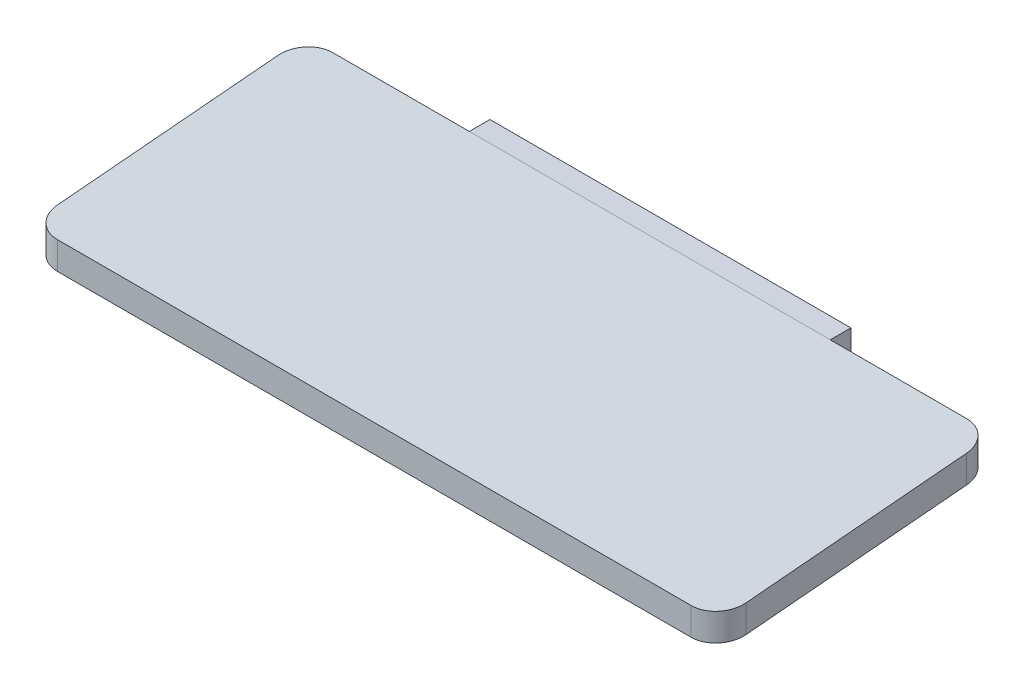
ISO-10303-21;
HEADER;
FILE_DESCRIPTION(('STEP AP214'),'2;1');
FILE_NAME('part.step','',(''),(''),'','','');
FILE_SCHEMA(('AUTOMOTIVE_DESIGN { 1 0 10303 214 1 1 1 1 }'));
ENDSEC;
DATA;
#1=APPLICATION_CONTEXT('core data for automotive mechanical design processes');
#2=APPLICATION_PROTOCOL_DEFINITION('international standard','automotive_design',2000,#1);
#3=PRODUCT_CONTEXT('',#1,'mechanical');
#4=PRODUCT('Part','Part','',(#3));
#5=PRODUCT_RELATED_PRODUCT_CATEGORY('part','',(#4));
#6=PRODUCT_DEFINITION_FORMATION('','',#4);
#7=PRODUCT_DEFINITION_CONTEXT('part definition',#1,'design');
#8=PRODUCT_DEFINITION('design','',#6,#7);
#9=PRODUCT_DEFINITION_SHAPE('','',#8);
#10=(LENGTH_UNIT() NAMED_UNIT(*) SI_UNIT(.MILLI.,.METRE.));
#11=(NAMED_UNIT(*) PLANE_ANGLE_UNIT() SI_UNIT($,.RADIAN.));
#12=(NAMED_UNIT(*) SI_UNIT($,.STERADIAN.) SOLID_ANGLE_UNIT());
#13=UNCERTAINTY_MEASURE_WITH_UNIT(LENGTH_MEASURE(1.E-05),#10,'distance_accuracy_value','');
#14=(GEOMETRIC_REPRESENTATION_CONTEXT(3) GLOBAL_UNCERTAINTY_ASSIGNED_CONTEXT((#13)) GLOBAL_UNIT_ASSIGNED_CONTEXT((#10,
#11,#12)) REPRESENTATION_CONTEXT('',''));
#15=CARTESIAN_POINT('',(0.,0.,0.));
#16=DIRECTION('',(0.,0.,1.));
#17=DIRECTION('',(1.,0.,0.));
#18=AXIS2_PLACEMENT_3D('',#15,#16,#17);
#19=CARTESIAN_POINT('',(0.,0.,1.5));
#20=DIRECTION('',(0.,0.,-1.));
#21=DIRECTION('',(-1.,0.,0.));
#22=AXIS2_PLACEMENT_3D('',#19,#20,#21);
#23=PLANE('',#22);
#24=CARTESIAN_POINT('',(-7.99999999999997,46.,1.5));
#25=DIRECTION('',(0.,0.,1.));
#26=DIRECTION('',(1.,0.,0.));
#27=AXIS2_PLACEMENT_3D('',#24,#25,#26);
#28=CIRCLE('',#27,2.1);
#29=CARTESIAN_POINT('',(-5.89999999999998,46.,1.5));
#30=VERTEX_POINT('',#29);
#31=EDGE_CURVE('E201',#30,#30,#28,.T.);
#32=ORIENTED_EDGE('',*,*,#31,.F.);
#33=EDGE_LOOP('',(#32));
#34=FACE_BOUND('',#33,.T.);
#35=CARTESIAN_POINT('',(8.00000000000003,46.,1.5));
#36=DIRECTION('',(0.,0.,1.));
#37=DIRECTION('',(1.,0.,0.));
#38=AXIS2_PLACEMENT_3D('',#35,#36,#37);
#39=CIRCLE('',#38,2.1);
#40=CARTESIAN_POINT('',(10.1,46.,1.5));
#41=VERTEX_POINT('',#40);
#42=EDGE_CURVE('E207',#41,#41,#39,.T.);
#43=ORIENTED_EDGE('',*,*,#42,.F.);
#44=EDGE_LOOP('',(#43));
#45=FACE_BOUND('',#44,.T.);
#46=DIRECTION('',(0.,-1.,0.));
#47=VECTOR('',#46,1.);
#48=CARTESIAN_POINT('',(-13.1,39.9,1.5));
#49=LINE('',#48,#47);
#50=CARTESIAN_POINT('',(-13.1,50.9,1.5));
#51=VERTEX_POINT('',#50);
#52=CARTESIAN_POINT('',(-13.1,41.9,1.5));
#53=VERTEX_POINT('',#52);
#54=EDGE_CURVE('E216',#51,#53,#49,.T.);
#55=ORIENTED_EDGE('',*,*,#54,.T.);
#56=CARTESIAN_POINT('',(-11.1,41.9,1.5));
#57=DIRECTION('',(0.,0.,-1.));
#58=DIRECTION('',(-1.,0.,0.));
#59=AXIS2_PLACEMENT_3D('',#56,#57,#58);
#60=CIRCLE('',#59,2.);
#61=CARTESIAN_POINT('',(-11.1,39.9,1.5));
#62=VERTEX_POINT('',#61);
#63=EDGE_CURVE('E256',#53,#62,#60,.F.);
#64=ORIENTED_EDGE('',*,*,#63,.T.);
#65=DIRECTION('',(1.,0.,0.));
#66=VECTOR('',#65,1.);
#67=CARTESIAN_POINT('',(-13.1,39.9,1.5));
#68=LINE('',#67,#66);
#69=CARTESIAN_POINT('',(11.1,39.9,1.5));
#70=VERTEX_POINT('',#69);
#71=EDGE_CURVE('E180',#62,#70,#68,.T.);
#72=ORIENTED_EDGE('',*,*,#71,.T.);
#73=CARTESIAN_POINT('',(11.1,41.9,1.5));
#74=DIRECTION('',(0.,0.,-1.));
#75=DIRECTION('',(-1.,0.,0.));
#76=AXIS2_PLACEMENT_3D('',#73,#74,#75);
#77=CIRCLE('',#76,2.);
#78=CARTESIAN_POINT('',(13.1,41.9,1.5));
#79=VERTEX_POINT('',#78);
#80=EDGE_CURVE('E254',#70,#79,#77,.F.);
#81=ORIENTED_EDGE('',*,*,#80,.T.);
#82=DIRECTION('',(0.,1.,0.));
#83=VECTOR('',#82,1.);
#84=CARTESIAN_POINT('',(13.1,39.9,1.5));
#85=LINE('',#84,#83);
#86=CARTESIAN_POINT('',(13.1,50.9,1.5));
#87=VERTEX_POINT('',#86);
#88=EDGE_CURVE('E179',#79,#87,#85,.T.);
#89=ORIENTED_EDGE('',*,*,#88,.T.);
#90=DIRECTION('',(-1.,0.,0.));
#91=VECTOR('',#90,1.);
#92=CARTESIAN_POINT('',(0.,50.9,1.5));
#93=LINE('',#92,#91);
#94=EDGE_CURVE('E167',#87,#51,#93,.T.);
#95=ORIENTED_EDGE('',*,*,#94,.T.);
#96=EDGE_LOOP('',(#55,#64,#72,#81,#89,#95));
#97=FACE_BOUND('',#96,.T.);
#98=ADVANCED_FACE('F35',(#34,#45,#97),#23,.F.);
#99=CARTESIAN_POINT('',(0.,0.,0.));
#100=DIRECTION('',(0.,0.,-1.));
#101=DIRECTION('',(-1.,0.,0.));
#102=AXIS2_PLACEMENT_3D('',#99,#100,#101);
#103=PLANE('',#102);
#104=CARTESIAN_POINT('',(8.00000000000003,46.,0.));
#105=DIRECTION('',(0.,0.,1.));
#106=DIRECTION('',(1.,0.,0.));
#107=AXIS2_PLACEMENT_3D('',#104,#105,#106);
#108=CIRCLE('',#107,2.1);
#109=CARTESIAN_POINT('',(10.1,46.,0.));
#110=VERTEX_POINT('',#109);
#111=EDGE_CURVE('E204',#110,#110,#108,.T.);
#112=ORIENTED_EDGE('',*,*,#111,.T.);
#113=EDGE_LOOP('',(#112));
#114=FACE_BOUND('',#113,.T.);
#115=DIRECTION('',(1.,0.,0.));
#116=VECTOR('',#115,1.);
#117=CARTESIAN_POINT('',(-13.1,39.9,0.));
#118=LINE('',#117,#116);
#119=CARTESIAN_POINT('',(-11.1,39.9,0.));
#120=VERTEX_POINT('',#119);
#121=CARTESIAN_POINT('',(11.1,39.9,0.));
#122=VERTEX_POINT('',#121);
#123=EDGE_CURVE('E225',#120,#122,#118,.T.);
#124=ORIENTED_EDGE('',*,*,#123,.F.);
#125=CARTESIAN_POINT('',(-11.1,41.9,0.));
#126=DIRECTION('',(0.,0.,-1.));
#127=DIRECTION('',(-1.,0.,0.));
#128=AXIS2_PLACEMENT_3D('',#125,#126,#127);
#129=CIRCLE('',#128,2.);
#130=CARTESIAN_POINT('',(-13.1,41.9,0.));
#131=VERTEX_POINT('',#130);
#132=EDGE_CURVE('E250',#120,#131,#129,.T.);
#133=ORIENTED_EDGE('',*,*,#132,.T.);
#134=DIRECTION('',(0.,-1.,0.));
#135=VECTOR('',#134,1.);
#136=CARTESIAN_POINT('',(-13.1,39.9,0.));
#137=LINE('',#136,#135);
#138=CARTESIAN_POINT('',(-13.1,55.9,0.));
#139=VERTEX_POINT('',#138);
#140=EDGE_CURVE('E210',#139,#131,#137,.T.);
#141=ORIENTED_EDGE('',*,*,#140,.F.);
#142=DIRECTION('',(-1.,0.,0.));
#143=VECTOR('',#142,1.);
#144=CARTESIAN_POINT('',(-13.1,55.9,0.));
#145=LINE('',#144,#143);
#146=CARTESIAN_POINT('',(13.1,55.9,0.));
#147=VERTEX_POINT('',#146);
#148=EDGE_CURVE('E230',#147,#139,#145,.T.);
#149=ORIENTED_EDGE('',*,*,#148,.F.);
#150=DIRECTION('',(0.,1.,0.));
#151=VECTOR('',#150,1.);
#152=CARTESIAN_POINT('',(13.1,39.9,0.));
#153=LINE('',#152,#151);
#154=CARTESIAN_POINT('',(13.1,41.9,0.));
#155=VERTEX_POINT('',#154);
#156=EDGE_CURVE('E228',#155,#147,#153,.T.);
#157=ORIENTED_EDGE('',*,*,#156,.F.);
#158=CARTESIAN_POINT('',(11.1,41.9,0.));
#159=DIRECTION('',(0.,0.,-1.));
#160=DIRECTION('',(-1.,0.,0.));
#161=AXIS2_PLACEMENT_3D('',#158,#159,#160);
#162=CIRCLE('',#161,2.);
#163=EDGE_CURVE('E248',#155,#122,#162,.T.);
#164=ORIENTED_EDGE('',*,*,#163,.T.);
#165=EDGE_LOOP('',(#124,#133,#141,#149,#157,#164));
#166=FACE_BOUND('',#165,.T.);
#167=CARTESIAN_POINT('',(-7.99999999999997,46.,0.));
#168=DIRECTION('',(0.,0.,1.));
#169=DIRECTION('',(1.,0.,0.));
#170=AXIS2_PLACEMENT_3D('',#167,#168,#169);
#171=CIRCLE('',#170,2.1);
#172=CARTESIAN_POINT('',(-5.89999999999998,46.,0.));
#173=VERTEX_POINT('',#172);
#174=EDGE_CURVE('E188',#173,#173,#171,.T.);
#175=ORIENTED_EDGE('',*,*,#174,.T.);
#176=EDGE_LOOP('',(#175));
#177=FACE_BOUND('',#176,.T.);
#178=ADVANCED_FACE('F330',(#114,#166,#177),#103,.T.);
#179=CARTESIAN_POINT('',(-13.1,39.9,1.5));
#180=DIRECTION('',(1.,0.,0.));
#181=DIRECTION('',(0.,0.,-1.));
#182=AXIS2_PLACEMENT_3D('',#179,#180,#181);
#183=PLANE('',#182);
#184=ORIENTED_EDGE('',*,*,#140,.T.);
#185=DIRECTION('',(0.,0.,-1.));
#186=VECTOR('',#185,1.);
#187=CARTESIAN_POINT('',(-13.1,41.9,1.5));
#188=LINE('',#187,#186);
#189=EDGE_CURVE('E252',#131,#53,#188,.F.);
#190=ORIENTED_EDGE('',*,*,#189,.T.);
#191=ORIENTED_EDGE('',*,*,#54,.F.);
#192=DIRECTION('',(0.,0.707106781186545,0.70710678118655));
#193=VECTOR('',#192,1.);
#194=CARTESIAN_POINT('',(-13.1,45.4,-4.));
#195=LINE('',#194,#193);
#196=CARTESIAN_POINT('',(-13.1,53.6586494467659,4.25864944676595));
#197=VERTEX_POINT('',#196);
#198=EDGE_CURVE('E241',#51,#197,#195,.T.);
#199=ORIENTED_EDGE('',*,*,#198,.T.);
#200=DIRECTION('',(0.,-0.0871557427476516,0.996194698091746));
#201=VECTOR('',#200,1.);
#202=CARTESIAN_POINT('',(-13.1,52.1502267294817,21.5));
#203=LINE('',#202,#201);
#204=CARTESIAN_POINT('',(-13.1,53.9,1.5));
#205=VERTEX_POINT('',#204);
#206=EDGE_CURVE('E235',#205,#197,#203,.T.);
#207=ORIENTED_EDGE('',*,*,#206,.F.);
#208=CARTESIAN_POINT('',(-13.1,55.9,1.5));
#209=VERTEX_POINT('',#208);
#210=EDGE_CURVE('E213',#209,#205,#49,.T.);
#211=ORIENTED_EDGE('',*,*,#210,.F.);
#212=DIRECTION('',(0.,0.,-1.));
#213=VECTOR('',#212,1.);
#214=CARTESIAN_POINT('',(-13.1,55.9,1.5));
#215=LINE('',#214,#213);
#216=EDGE_CURVE('E222',#209,#139,#215,.T.);
#217=ORIENTED_EDGE('',*,*,#216,.T.);
#218=EDGE_LOOP('',(#184,#190,#191,#199,#207,#211,#217));
#219=FACE_BOUND('',#218,.T.);
#220=ADVANCED_FACE('F336',(#219),#183,.F.);
#221=CARTESIAN_POINT('',(-13.1,39.9,1.5));
#222=DIRECTION('',(0.,1.,0.));
#223=DIRECTION('',(0.,0.,1.));
#224=AXIS2_PLACEMENT_3D('',#221,#222,#223);
#225=PLANE('',#224);
#226=ORIENTED_EDGE('',*,*,#71,.F.);
#227=DIRECTION('',(0.,0.,-1.));
#228=VECTOR('',#227,1.);
#229=CARTESIAN_POINT('',(-11.1,39.9,1.5));
#230=LINE('',#229,#228);
#231=EDGE_CURVE('E245',#62,#120,#230,.T.);
#232=ORIENTED_EDGE('',*,*,#231,.T.);
#233=ORIENTED_EDGE('',*,*,#123,.T.);
#234=DIRECTION('',(0.,0.,-1.));
#235=VECTOR('',#234,1.);
#236=CARTESIAN_POINT('',(11.1,39.9,1.5));
#237=LINE('',#236,#235);
#238=EDGE_CURVE('E243',#122,#70,#237,.F.);
#239=ORIENTED_EDGE('',*,*,#238,.T.);
#240=EDGE_LOOP('',(#226,#232,#233,#239));
#241=FACE_BOUND('',#240,.T.);
#242=ADVANCED_FACE('F351',(#241),#225,.F.);
#243=CARTESIAN_POINT('',(13.1,39.9,1.5));
#244=DIRECTION('',(-1.,0.,0.));
#245=DIRECTION('',(0.,0.,1.));
#246=AXIS2_PLACEMENT_3D('',#243,#244,#245);
#247=PLANE('',#246);
#248=ORIENTED_EDGE('',*,*,#88,.F.);
#249=DIRECTION('',(0.,0.,-1.));
#250=VECTOR('',#249,1.);
#251=CARTESIAN_POINT('',(13.1,41.9,1.5));
#252=LINE('',#251,#250);
#253=EDGE_CURVE('E258',#79,#155,#252,.T.);
#254=ORIENTED_EDGE('',*,*,#253,.T.);
#255=ORIENTED_EDGE('',*,*,#156,.T.);
#256=DIRECTION('',(0.,0.,-1.));
#257=VECTOR('',#256,1.);
#258=CARTESIAN_POINT('',(13.1,55.9,1.5));
#259=LINE('',#258,#257);
#260=CARTESIAN_POINT('',(13.1,55.9,1.5));
#261=VERTEX_POINT('',#260);
#262=EDGE_CURVE('E174',#261,#147,#259,.T.);
#263=ORIENTED_EDGE('',*,*,#262,.F.);
#264=CARTESIAN_POINT('',(13.1,53.9,1.5));
#265=VERTEX_POINT('',#264);
#266=EDGE_CURVE('E170',#265,#261,#85,.T.);
#267=ORIENTED_EDGE('',*,*,#266,.F.);
#268=DIRECTION('',(0.,0.0871557427476516,-0.996194698091746));
#269=VECTOR('',#268,1.);
#270=CARTESIAN_POINT('',(13.1,52.1502267294817,21.5));
#271=LINE('',#270,#269);
#272=CARTESIAN_POINT('',(13.1,53.6586494467659,4.25864944676595));
#273=VERTEX_POINT('',#272);
#274=EDGE_CURVE('E156',#273,#265,#271,.T.);
#275=ORIENTED_EDGE('',*,*,#274,.F.);
#276=DIRECTION('',(0.,-0.707106781186545,-0.70710678118655));
#277=VECTOR('',#276,1.);
#278=CARTESIAN_POINT('',(13.1,45.4,-4.));
#279=LINE('',#278,#277);
#280=EDGE_CURVE('E239',#273,#87,#279,.T.);
#281=ORIENTED_EDGE('',*,*,#280,.T.);
#282=EDGE_LOOP('',(#248,#254,#255,#263,#267,#275,#281));
#283=FACE_BOUND('',#282,.T.);
#284=ADVANCED_FACE('F172',(#283),#247,.F.);
#285=CARTESIAN_POINT('',(-13.1,55.9,1.5));
#286=DIRECTION('',(0.,-1.,0.));
#287=DIRECTION('',(0.,0.,-1.));
#288=AXIS2_PLACEMENT_3D('',#285,#286,#287);
#289=PLANE('',#288);
#290=ORIENTED_EDGE('',*,*,#148,.T.);
#291=ORIENTED_EDGE('',*,*,#216,.F.);
#292=DIRECTION('',(-1.,0.,0.));
#293=VECTOR('',#292,1.);
#294=CARTESIAN_POINT('',(-13.1,55.9,1.5));
#295=LINE('',#294,#293);
#296=EDGE_CURVE('E219',#261,#209,#295,.T.);
#297=ORIENTED_EDGE('',*,*,#296,.F.);
#298=ORIENTED_EDGE('',*,*,#262,.T.);
#299=EDGE_LOOP('',(#290,#291,#297,#298));
#300=FACE_BOUND('',#299,.T.);
#301=ADVANCED_FACE('F345',(#300),#289,.F.);
#302=CARTESIAN_POINT('',(8.00000000000003,46.,1.5));
#303=DIRECTION('',(0.,0.,-1.));
#304=DIRECTION('',(-1.,0.,0.));
#305=AXIS2_PLACEMENT_3D('',#302,#303,#304);
#306=CYLINDRICAL_SURFACE('',#305,2.1);
#307=ORIENTED_EDGE('',*,*,#42,.T.);
#308=EDGE_LOOP('',(#307));
#309=FACE_BOUND('',#308,.T.);
#310=ORIENTED_EDGE('',*,*,#111,.F.);
#311=EDGE_LOOP('',(#310));
#312=FACE_BOUND('',#311,.T.);
#313=ADVANCED_FACE('F342',(#309,#312),#306,.F.);
#314=CARTESIAN_POINT('',(-7.99999999999997,46.,1.5));
#315=DIRECTION('',(0.,0.,-1.));
#316=DIRECTION('',(-1.,0.,0.));
#317=AXIS2_PLACEMENT_3D('',#314,#315,#316);
#318=CYLINDRICAL_SURFACE('',#317,2.1);
#319=ORIENTED_EDGE('',*,*,#31,.T.);
#320=EDGE_LOOP('',(#319));
#321=FACE_BOUND('',#320,.T.);
#322=ORIENTED_EDGE('',*,*,#174,.F.);
#323=EDGE_LOOP('',(#322));
#324=FACE_BOUND('',#323,.T.);
#325=ADVANCED_FACE('F395',(#321,#324),#318,.F.);
#326=CARTESIAN_POINT('',(-25.,53.9,1.5));
#327=DIRECTION('',(0.,0.,-1.));
#328=DIRECTION('',(0.,1.,0.));
#329=AXIS2_PLACEMENT_3D('',#326,#327,#328);
#330=PLANE('',#329);
#331=DIRECTION('',(1.,0.,0.));
#332=VECTOR('',#331,1.);
#333=CARTESIAN_POINT('',(-25.,53.9,1.5));
#334=LINE('',#333,#332);
#335=CARTESIAN_POINT('',(-23.,53.9,1.5));
#336=VERTEX_POINT('',#335);
#337=EDGE_CURVE('E185',#336,#205,#334,.T.);
#338=ORIENTED_EDGE('',*,*,#337,.F.);
#339=DIRECTION('',(0.,1.,0.));
#340=VECTOR('',#339,1.);
#341=CARTESIAN_POINT('',(-23.,55.9,1.5));
#342=LINE('',#341,#340);
#343=CARTESIAN_POINT('',(-23.,55.9,1.5));
#344=VERTEX_POINT('',#343);
#345=EDGE_CURVE('E283',#336,#344,#342,.T.);
#346=ORIENTED_EDGE('',*,*,#345,.T.);
#347=DIRECTION('',(1.,0.,0.));
#348=VECTOR('',#347,1.);
#349=CARTESIAN_POINT('',(-25.,55.9,1.5));
#350=LINE('',#349,#348);
#351=EDGE_CURVE('E198',#344,#209,#350,.T.);
#352=ORIENTED_EDGE('',*,*,#351,.T.);
#353=ORIENTED_EDGE('',*,*,#210,.T.);
#354=EDGE_LOOP('',(#338,#346,#352,#353));
#355=FACE_BOUND('',#354,.T.);
#356=ADVANCED_FACE('F392',(#355),#330,.T.);
#357=CARTESIAN_POINT('',(23.,55.9,1.5));
#358=VERTEX_POINT('',#357);
#359=EDGE_CURVE('E200',#261,#358,#350,.T.);
#360=ORIENTED_EDGE('',*,*,#359,.T.);
#361=DIRECTION('',(0.,1.,0.));
#362=VECTOR('',#361,1.);
#363=CARTESIAN_POINT('',(23.,53.9,1.5));
#364=LINE('',#363,#362);
#365=CARTESIAN_POINT('',(23.,53.9,1.5));
#366=VERTEX_POINT('',#365);
#367=EDGE_CURVE('E184',#358,#366,#364,.F.);
#368=ORIENTED_EDGE('',*,*,#367,.T.);
#369=EDGE_CURVE('E160',#265,#366,#334,.T.);
#370=ORIENTED_EDGE('',*,*,#369,.F.);
#371=ORIENTED_EDGE('',*,*,#266,.T.);
#372=EDGE_LOOP('',(#360,#368,#370,#371));
#373=FACE_BOUND('',#372,.T.);
#374=ADVANCED_FACE('F182',(#373),#330,.T.);
#375=CARTESIAN_POINT('',(-25.,52.1502267294817,21.5));
#376=DIRECTION('',(0.,-0.996194698091746,-0.0871557427476516));
#377=DIRECTION('',(0.,0.0871557427476516,-0.996194698091746));
#378=AXIS2_PLACEMENT_3D('',#375,#376,#377);
#379=PLANE('',#378);
#380=ORIENTED_EDGE('',*,*,#369,.T.);
#381=CARTESIAN_POINT('',(23.,53.7250226729482,3.5));
#382=DIRECTION('',(0.,-0.996194698091746,-0.0871557427476516));
#383=DIRECTION('',(0.,0.0871557427476516,-0.996194698091746));
#384=AXIS2_PLACEMENT_3D('',#381,#382,#383);
#385=ELLIPSE('',#384,2.00763967508669,2.);
#386=CARTESIAN_POINT('',(25.,53.7250226729482,3.5));
#387=VERTEX_POINT('',#386);
#388=EDGE_CURVE('E281',#366,#387,#385,.T.);
#389=ORIENTED_EDGE('',*,*,#388,.T.);
#390=DIRECTION('',(0.,0.0871557427476516,-0.996194698091746));
#391=VECTOR('',#390,1.);
#392=CARTESIAN_POINT('',(25.,52.1502267294817,21.5));
#393=LINE('',#392,#391);
#394=CARTESIAN_POINT('',(25.,52.3252040565335,19.5));
#395=VERTEX_POINT('',#394);
#396=EDGE_CURVE('E193',#395,#387,#393,.T.);
#397=ORIENTED_EDGE('',*,*,#396,.F.);
#398=CARTESIAN_POINT('',(23.,52.3252040565335,19.5));
#399=DIRECTION('',(0.,-0.996194698091746,-0.0871557427476516));
#400=DIRECTION('',(0.,-0.0871557427476516,0.996194698091746));
#401=AXIS2_PLACEMENT_3D('',#398,#399,#400);
#402=ELLIPSE('',#401,2.00763967508669,2.);
#403=CARTESIAN_POINT('',(23.,52.1502267294817,21.5));
#404=VERTEX_POINT('',#403);
#405=EDGE_CURVE('E276',#395,#404,#402,.T.);
#406=ORIENTED_EDGE('',*,*,#405,.T.);
#407=DIRECTION('',(1.,0.,0.));
#408=VECTOR('',#407,1.);
#409=CARTESIAN_POINT('',(-25.,52.1502267294817,21.5));
#410=LINE('',#409,#408);
#411=CARTESIAN_POINT('',(-23.,52.1502267294817,21.5));
#412=VERTEX_POINT('',#411);
#413=EDGE_CURVE('E186',#412,#404,#410,.T.);
#414=ORIENTED_EDGE('',*,*,#413,.F.);
#415=CARTESIAN_POINT('',(-23.,52.3252040565335,19.5));
#416=DIRECTION('',(0.,-0.996194698091746,-0.0871557427476516));
#417=DIRECTION('',(0.,0.0871557427476516,-0.996194698091746));
#418=AXIS2_PLACEMENT_3D('',#415,#416,#417);
#419=ELLIPSE('',#418,2.00763967508669,2.);
#420=CARTESIAN_POINT('',(-25.,52.3252040565335,19.5));
#421=VERTEX_POINT('',#420);
#422=EDGE_CURVE('E278',#412,#421,#419,.T.);
#423=ORIENTED_EDGE('',*,*,#422,.T.);
#424=DIRECTION('',(0.,0.0871557427476516,-0.996194698091746));
#425=VECTOR('',#424,1.);
#426=CARTESIAN_POINT('',(-25.,52.1502267294817,21.5));
#427=LINE('',#426,#425);
#428=CARTESIAN_POINT('',(-25.,53.7250226729482,3.5));
#429=VERTEX_POINT('',#428);
#430=EDGE_CURVE('E310',#421,#429,#427,.T.);
#431=ORIENTED_EDGE('',*,*,#430,.T.);
#432=CARTESIAN_POINT('',(-23.,53.7250226729482,3.5));
#433=DIRECTION('',(0.,-0.996194698091746,-0.0871557427476516));
#434=DIRECTION('',(0.,-0.0871557427476516,0.996194698091746));
#435=AXIS2_PLACEMENT_3D('',#432,#433,#434);
#436=ELLIPSE('',#435,2.00763967508669,2.);
#437=EDGE_CURVE('E50',#429,#336,#436,.T.);
#438=ORIENTED_EDGE('',*,*,#437,.T.);
#439=ORIENTED_EDGE('',*,*,#337,.T.);
#440=ORIENTED_EDGE('',*,*,#206,.T.);
#441=DIRECTION('',(1.,0.,0.));
#442=VECTOR('',#441,1.);
#443=CARTESIAN_POINT('',(-25.,53.6586494467659,4.25864944676595));
#444=LINE('',#443,#442);
#445=EDGE_CURVE('E164',#197,#273,#444,.T.);
#446=ORIENTED_EDGE('',*,*,#445,.T.);
#447=ORIENTED_EDGE('',*,*,#274,.T.);
#448=EDGE_LOOP('',(#380,#389,#397,#406,#414,#423,#431,#438,#439,#440,#446,#447));
#449=FACE_BOUND('',#448,.T.);
#450=ADVANCED_FACE('F158',(#449),#379,.T.);
#451=CARTESIAN_POINT('',(-25.,54.1502267294817,21.5));
#452=DIRECTION('',(0.,0.,1.));
#453=DIRECTION('',(1.,0.,0.));
#454=AXIS2_PLACEMENT_3D('',#451,#452,#453);
#455=PLANE('',#454);
#456=DIRECTION('',(1.,0.,0.));
#457=VECTOR('',#456,1.);
#458=CARTESIAN_POINT('',(-25.,54.1502267294817,21.5));
#459=LINE('',#458,#457);
#460=CARTESIAN_POINT('',(-23.,54.1502267294817,21.5));
#461=VERTEX_POINT('',#460);
#462=CARTESIAN_POINT('',(23.,54.1502267294817,21.5));
#463=VERTEX_POINT('',#462);
#464=EDGE_CURVE('E190',#461,#463,#459,.T.);
#465=ORIENTED_EDGE('',*,*,#464,.F.);
#466=DIRECTION('',(0.,-1.,0.));
#467=VECTOR('',#466,1.);
#468=CARTESIAN_POINT('',(-23.,52.1502267294817,21.5));
#469=LINE('',#468,#467);
#470=EDGE_CURVE('E11',#461,#412,#469,.T.);
#471=ORIENTED_EDGE('',*,*,#470,.T.);
#472=ORIENTED_EDGE('',*,*,#413,.T.);
#473=DIRECTION('',(0.,-1.,0.));
#474=VECTOR('',#473,1.);
#475=CARTESIAN_POINT('',(23.,54.1502267294817,21.5));
#476=LINE('',#475,#474);
#477=EDGE_CURVE('E43',#404,#463,#476,.F.);
#478=ORIENTED_EDGE('',*,*,#477,.T.);
#479=EDGE_LOOP('',(#465,#471,#472,#478));
#480=FACE_BOUND('',#479,.T.);
#481=ADVANCED_FACE('F291',(#480),#455,.T.);
#482=CARTESIAN_POINT('',(-25.,55.9,1.5));
#483=DIRECTION('',(0.,0.996194698091746,0.0871557427476516));
#484=DIRECTION('',(0.,-0.0871557427476516,0.996194698091746));
#485=AXIS2_PLACEMENT_3D('',#482,#483,#484);
#486=PLANE('',#485);
#487=DIRECTION('',(0.,-0.0871557427476516,0.996194698091746));
#488=VECTOR('',#487,1.);
#489=CARTESIAN_POINT('',(25.,55.9,1.5));
#490=LINE('',#489,#488);
#491=CARTESIAN_POINT('',(25.,55.7250226729482,3.5));
#492=VERTEX_POINT('',#491);
#493=CARTESIAN_POINT('',(25.,54.3252040565335,19.5));
#494=VERTEX_POINT('',#493);
#495=EDGE_CURVE('E308',#492,#494,#490,.T.);
#496=ORIENTED_EDGE('',*,*,#495,.F.);
#497=CARTESIAN_POINT('',(23.,55.7250226729482,3.5));
#498=DIRECTION('',(0.,0.996194698091746,0.0871557427476516));
#499=DIRECTION('',(0.,0.0871557427476516,-0.996194698091746));
#500=AXIS2_PLACEMENT_3D('',#497,#498,#499);
#501=ELLIPSE('',#500,2.00763967508669,2.);
#502=EDGE_CURVE('E273',#492,#358,#501,.T.);
#503=ORIENTED_EDGE('',*,*,#502,.T.);
#504=ORIENTED_EDGE('',*,*,#359,.F.);
#505=ORIENTED_EDGE('',*,*,#296,.T.);
#506=ORIENTED_EDGE('',*,*,#351,.F.);
#507=CARTESIAN_POINT('',(-23.,55.7250226729482,3.5));
#508=DIRECTION('',(0.,0.996194698091746,0.0871557427476516));
#509=DIRECTION('',(0.,-0.0871557427476516,0.996194698091746));
#510=AXIS2_PLACEMENT_3D('',#507,#508,#509);
#511=ELLIPSE('',#510,2.00763967508669,2.);
#512=CARTESIAN_POINT('',(-25.,55.7250226729482,3.5));
#513=VERTEX_POINT('',#512);
#514=EDGE_CURVE('E271',#344,#513,#511,.T.);
#515=ORIENTED_EDGE('',*,*,#514,.T.);
#516=DIRECTION('',(0.,-0.0871557427476516,0.996194698091746));
#517=VECTOR('',#516,1.);
#518=CARTESIAN_POINT('',(-25.,55.9,1.5));
#519=LINE('',#518,#517);
#520=CARTESIAN_POINT('',(-25.,54.3252040565335,19.5));
#521=VERTEX_POINT('',#520);
#522=EDGE_CURVE('E309',#513,#521,#519,.T.);
#523=ORIENTED_EDGE('',*,*,#522,.T.);
#524=CARTESIAN_POINT('',(-23.,54.3252040565335,19.5));
#525=DIRECTION('',(0.,0.996194698091746,0.0871557427476516));
#526=DIRECTION('',(0.,0.0871557427476516,-0.996194698091746));
#527=AXIS2_PLACEMENT_3D('',#524,#525,#526);
#528=ELLIPSE('',#527,2.00763967508669,2.);
#529=EDGE_CURVE('E269',#521,#461,#528,.T.);
#530=ORIENTED_EDGE('',*,*,#529,.T.);
#531=ORIENTED_EDGE('',*,*,#464,.T.);
#532=CARTESIAN_POINT('',(23.,54.3252040565335,19.5));
#533=DIRECTION('',(0.,0.996194698091746,0.0871557427476516));
#534=DIRECTION('',(0.,-0.0871557427476516,0.996194698091746));
#535=AXIS2_PLACEMENT_3D('',#532,#533,#534);
#536=ELLIPSE('',#535,2.00763967508669,2.);
#537=EDGE_CURVE('E267',#463,#494,#536,.T.);
#538=ORIENTED_EDGE('',*,*,#537,.T.);
#539=EDGE_LOOP('',(#496,#503,#504,#505,#506,#515,#523,#530,#531,#538));
#540=FACE_BOUND('',#539,.T.);
#541=ADVANCED_FACE('F298',(#540),#486,.T.);
#542=CARTESIAN_POINT('',(-25.,0.,0.));
#543=DIRECTION('',(1.,0.,0.));
#544=DIRECTION('',(0.,0.,-1.));
#545=AXIS2_PLACEMENT_3D('',#542,#543,#544);
#546=PLANE('',#545);
#547=ORIENTED_EDGE('',*,*,#522,.F.);
#548=DIRECTION('',(0.,1.,0.));
#549=VECTOR('',#548,1.);
#550=CARTESIAN_POINT('',(-25.,53.9,3.5));
#551=LINE('',#550,#549);
#552=EDGE_CURVE('E58',#513,#429,#551,.F.);
#553=ORIENTED_EDGE('',*,*,#552,.T.);
#554=ORIENTED_EDGE('',*,*,#430,.F.);
#555=DIRECTION('',(0.,-1.,0.));
#556=VECTOR('',#555,1.);
#557=CARTESIAN_POINT('',(-25.,54.1502267294817,19.5));
#558=LINE('',#557,#556);
#559=EDGE_CURVE('E286',#421,#521,#558,.F.);
#560=ORIENTED_EDGE('',*,*,#559,.T.);
#561=EDGE_LOOP('',(#547,#553,#554,#560));
#562=FACE_BOUND('',#561,.T.);
#563=ADVANCED_FACE('F405',(#562),#546,.F.);
#564=CARTESIAN_POINT('',(25.,0.,0.));
#565=DIRECTION('',(1.,0.,0.));
#566=DIRECTION('',(0.,0.,-1.));
#567=AXIS2_PLACEMENT_3D('',#564,#565,#566);
#568=PLANE('',#567);
#569=ORIENTED_EDGE('',*,*,#396,.T.);
#570=DIRECTION('',(0.,1.,0.));
#571=VECTOR('',#570,1.);
#572=CARTESIAN_POINT('',(25.,0.,3.49999999999999));
#573=LINE('',#572,#571);
#574=EDGE_CURVE('E264',#387,#492,#573,.T.);
#575=ORIENTED_EDGE('',*,*,#574,.T.);
#576=ORIENTED_EDGE('',*,*,#495,.T.);
#577=DIRECTION('',(0.,-1.,0.));
#578=VECTOR('',#577,1.);
#579=CARTESIAN_POINT('',(25.,0.,19.5));
#580=LINE('',#579,#578);
#581=EDGE_CURVE('E261',#494,#395,#580,.T.);
#582=ORIENTED_EDGE('',*,*,#581,.T.);
#583=EDGE_LOOP('',(#569,#575,#576,#582));
#584=FACE_BOUND('',#583,.T.);
#585=ADVANCED_FACE('F306',(#584),#568,.T.);
#586=CARTESIAN_POINT('',(-25.,53.6586494467659,4.25864944676595));
#587=DIRECTION('',(0.,0.70710678118655,-0.707106781186545));
#588=DIRECTION('',(1.,0.,0.));
#589=AXIS2_PLACEMENT_3D('',#586,#587,#588);
#590=PLANE('',#589);
#591=ORIENTED_EDGE('',*,*,#198,.F.);
#592=ORIENTED_EDGE('',*,*,#94,.F.);
#593=ORIENTED_EDGE('',*,*,#280,.F.);
#594=ORIENTED_EDGE('',*,*,#445,.F.);
#595=EDGE_LOOP('',(#591,#592,#593,#594));
#596=FACE_BOUND('',#595,.T.);
#597=ADVANCED_FACE('F359',(#596),#590,.F.);
#598=CARTESIAN_POINT('',(-11.1,41.9,1.5));
#599=DIRECTION('',(0.,0.,-1.));
#600=DIRECTION('',(-1.,0.,0.));
#601=AXIS2_PLACEMENT_3D('',#598,#599,#600);
#602=CYLINDRICAL_SURFACE('',#601,2.);
#603=ORIENTED_EDGE('',*,*,#63,.F.);
#604=ORIENTED_EDGE('',*,*,#189,.F.);
#605=ORIENTED_EDGE('',*,*,#132,.F.);
#606=ORIENTED_EDGE('',*,*,#231,.F.);
#607=EDGE_LOOP('',(#603,#604,#605,#606));
#608=FACE_BOUND('',#607,.T.);
#609=ADVANCED_FACE('F326',(#608),#602,.T.);
#610=CARTESIAN_POINT('',(11.1,41.9,1.5));
#611=DIRECTION('',(0.,0.,-1.));
#612=DIRECTION('',(-1.,0.,0.));
#613=AXIS2_PLACEMENT_3D('',#610,#611,#612);
#614=CYLINDRICAL_SURFACE('',#613,2.);
#615=ORIENTED_EDGE('',*,*,#80,.F.);
#616=ORIENTED_EDGE('',*,*,#238,.F.);
#617=ORIENTED_EDGE('',*,*,#163,.F.);
#618=ORIENTED_EDGE('',*,*,#253,.F.);
#619=EDGE_LOOP('',(#615,#616,#617,#618));
#620=FACE_BOUND('',#619,.T.);
#621=ADVANCED_FACE('F317',(#620),#614,.T.);
#622=CARTESIAN_POINT('',(23.,0.,3.49999999999999));
#623=DIRECTION('',(0.,1.,0.));
#624=DIRECTION('',(0.,0.,1.));
#625=AXIS2_PLACEMENT_3D('',#622,#623,#624);
#626=CYLINDRICAL_SURFACE('',#625,2.);
#627=ORIENTED_EDGE('',*,*,#388,.F.);
#628=ORIENTED_EDGE('',*,*,#367,.F.);
#629=ORIENTED_EDGE('',*,*,#502,.F.);
#630=ORIENTED_EDGE('',*,*,#574,.F.);
#631=EDGE_LOOP('',(#627,#628,#629,#630));
#632=FACE_BOUND('',#631,.T.);
#633=ADVANCED_FACE('F314',(#632),#626,.T.);
#634=CARTESIAN_POINT('',(-23.,53.9,3.5));
#635=DIRECTION('',(0.,-1.,0.));
#636=DIRECTION('',(0.,0.,-1.));
#637=AXIS2_PLACEMENT_3D('',#634,#635,#636);
#638=CYLINDRICAL_SURFACE('',#637,2.);
#639=ORIENTED_EDGE('',*,*,#437,.F.);
#640=ORIENTED_EDGE('',*,*,#552,.F.);
#641=ORIENTED_EDGE('',*,*,#514,.F.);
#642=ORIENTED_EDGE('',*,*,#345,.F.);
#643=EDGE_LOOP('',(#639,#640,#641,#642));
#644=FACE_BOUND('',#643,.T.);
#645=ADVANCED_FACE('F316',(#644),#638,.T.);
#646=CARTESIAN_POINT('',(-23.,54.1502267294817,19.5));
#647=DIRECTION('',(0.,1.,0.));
#648=DIRECTION('',(0.,0.,1.));
#649=AXIS2_PLACEMENT_3D('',#646,#647,#648);
#650=CYLINDRICAL_SURFACE('',#649,2.);
#651=ORIENTED_EDGE('',*,*,#529,.F.);
#652=ORIENTED_EDGE('',*,*,#559,.F.);
#653=ORIENTED_EDGE('',*,*,#422,.F.);
#654=ORIENTED_EDGE('',*,*,#470,.F.);
#655=EDGE_LOOP('',(#651,#652,#653,#654));
#656=FACE_BOUND('',#655,.T.);
#657=ADVANCED_FACE('F323',(#656),#650,.T.);
#658=CARTESIAN_POINT('',(23.,0.,19.5));
#659=DIRECTION('',(0.,-1.,0.));
#660=DIRECTION('',(0.,0.,-1.));
#661=AXIS2_PLACEMENT_3D('',#658,#659,#660);
#662=CYLINDRICAL_SURFACE('',#661,2.);
#663=ORIENTED_EDGE('',*,*,#537,.F.);
#664=ORIENTED_EDGE('',*,*,#477,.F.);
#665=ORIENTED_EDGE('',*,*,#405,.F.);
#666=ORIENTED_EDGE('',*,*,#581,.F.);
#667=EDGE_LOOP('',(#663,#664,#665,#666));
#668=FACE_BOUND('',#667,.T.);
#669=ADVANCED_FACE('F37',(#668),#662,.T.);
#670=CLOSED_SHELL('',(#98,#178,#220,#242,#284,#301,#313,#325,#356,#374,#450,#481,#541,#563,#585,
#597,#609,#621,#633,#645,#657,#669));
#671=MANIFOLD_SOLID_BREP('B2',#670);
#672=ADVANCED_BREP_SHAPE_REPRESENTATION('',(#18,#671),#14);
#673=SHAPE_DEFINITION_REPRESENTATION(#9,#672);
ENDSEC;
END-ISO-10303-21;
